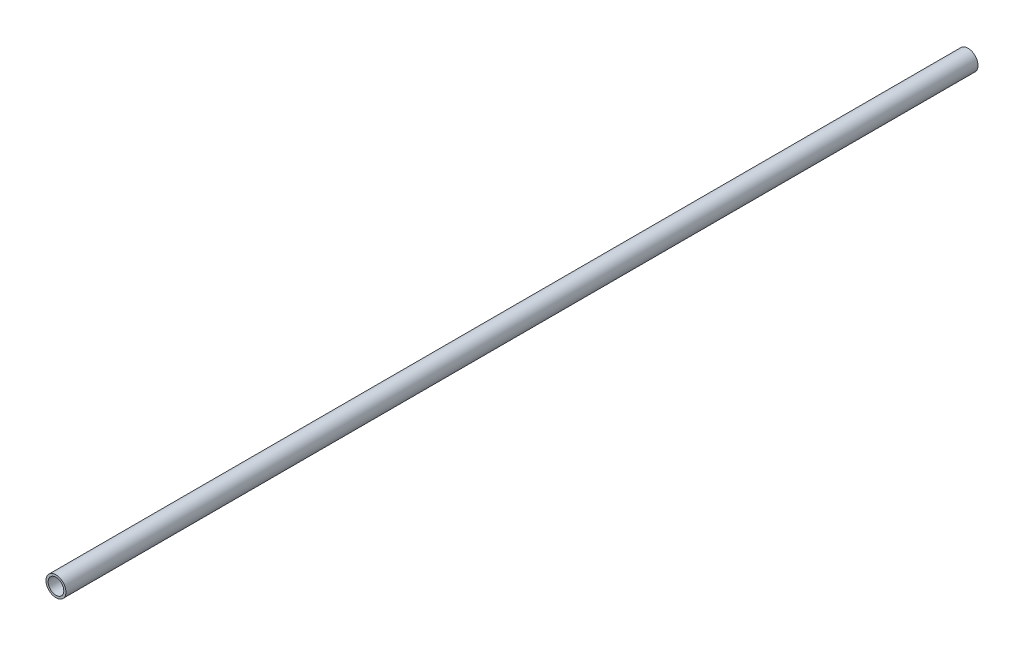
ISO-10303-21;
HEADER;
FILE_DESCRIPTION(('STEP AP214'),'2;1');
FILE_NAME('part.step','',(''),(''),'','','');
FILE_SCHEMA(('AUTOMOTIVE_DESIGN { 1 0 10303 214 1 1 1 1 }'));
ENDSEC;
DATA;
#1=APPLICATION_CONTEXT('core data for automotive mechanical design processes');
#2=APPLICATION_PROTOCOL_DEFINITION('international standard','automotive_design',2000,#1);
#3=PRODUCT_CONTEXT('',#1,'mechanical');
#4=PRODUCT('Part','Part','',(#3));
#5=PRODUCT_RELATED_PRODUCT_CATEGORY('part','',(#4));
#6=PRODUCT_DEFINITION_FORMATION('','',#4);
#7=PRODUCT_DEFINITION_CONTEXT('part definition',#1,'design');
#8=PRODUCT_DEFINITION('design','',#6,#7);
#9=PRODUCT_DEFINITION_SHAPE('','',#8);
#10=(LENGTH_UNIT() NAMED_UNIT(*) SI_UNIT(.MILLI.,.METRE.));
#11=(NAMED_UNIT(*) PLANE_ANGLE_UNIT() SI_UNIT($,.RADIAN.));
#12=(NAMED_UNIT(*) SI_UNIT($,.STERADIAN.) SOLID_ANGLE_UNIT());
#13=UNCERTAINTY_MEASURE_WITH_UNIT(LENGTH_MEASURE(1.E-05),#10,'distance_accuracy_value','');
#14=(GEOMETRIC_REPRESENTATION_CONTEXT(3) GLOBAL_UNCERTAINTY_ASSIGNED_CONTEXT((#13)) GLOBAL_UNIT_ASSIGNED_CONTEXT((#10,
#11,#12)) REPRESENTATION_CONTEXT('',''));
#15=CARTESIAN_POINT('',(0.,0.,0.));
#16=DIRECTION('',(0.,0.,1.));
#17=DIRECTION('',(1.,0.,0.));
#18=AXIS2_PLACEMENT_3D('',#15,#16,#17);
#19=CARTESIAN_POINT('',(0.,0.,762.));
#20=DIRECTION('',(0.,0.,-1.));
#21=DIRECTION('',(-1.,0.,0.));
#22=AXIS2_PLACEMENT_3D('',#19,#20,#21);
#23=CYLINDRICAL_SURFACE('',#22,13.335);
#24=CARTESIAN_POINT('',(0.,0.,-762.));
#25=DIRECTION('',(0.,0.,1.));
#26=DIRECTION('',(1.,0.,0.));
#27=AXIS2_PLACEMENT_3D('',#24,#25,#26);
#28=CIRCLE('',#27,13.335);
#29=CARTESIAN_POINT('',(13.335,0.,-762.));
#30=VERTEX_POINT('',#29);
#31=EDGE_CURVE('E11',#30,#30,#28,.T.);
#32=ORIENTED_EDGE('',*,*,#31,.T.);
#33=EDGE_LOOP('',(#32));
#34=FACE_BOUND('',#33,.T.);
#35=CARTESIAN_POINT('',(0.,0.,457.81833125));
#36=DIRECTION('',(0.,0.,1.));
#37=DIRECTION('',(1.,0.,0.));
#38=AXIS2_PLACEMENT_3D('',#35,#36,#37);
#39=CIRCLE('',#38,13.335);
#40=CARTESIAN_POINT('',(13.335,0.,457.81833125));
#41=VERTEX_POINT('',#40);
#42=EDGE_CURVE('E59',#41,#41,#39,.F.);
#43=ORIENTED_EDGE('',*,*,#42,.T.);
#44=EDGE_LOOP('',(#43));
#45=FACE_BOUND('',#44,.T.);
#46=ADVANCED_FACE('F42',(#34,#45),#23,.T.);
#47=CARTESIAN_POINT('',(0.,0.,762.));
#48=DIRECTION('',(0.,0.,-1.));
#49=DIRECTION('',(-1.,0.,0.));
#50=AXIS2_PLACEMENT_3D('',#47,#48,#49);
#51=CYLINDRICAL_SURFACE('',#50,10.4648);
#52=CARTESIAN_POINT('',(0.,0.,-762.));
#53=DIRECTION('',(0.,0.,1.));
#54=DIRECTION('',(1.,0.,0.));
#55=AXIS2_PLACEMENT_3D('',#52,#53,#54);
#56=CIRCLE('',#55,10.4648);
#57=CARTESIAN_POINT('',(10.4648,0.,-762.));
#58=VERTEX_POINT('',#57);
#59=EDGE_CURVE('E49',#58,#58,#56,.T.);
#60=ORIENTED_EDGE('',*,*,#59,.F.);
#61=EDGE_LOOP('',(#60));
#62=FACE_BOUND('',#61,.T.);
#63=CARTESIAN_POINT('',(0.,0.,457.81833125));
#64=DIRECTION('',(0.,0.,1.));
#65=DIRECTION('',(1.,0.,0.));
#66=AXIS2_PLACEMENT_3D('',#63,#64,#65);
#67=CIRCLE('',#66,10.4648);
#68=CARTESIAN_POINT('',(10.4648,0.,457.81833125));
#69=VERTEX_POINT('',#68);
#70=EDGE_CURVE('E54',#69,#69,#67,.F.);
#71=ORIENTED_EDGE('',*,*,#70,.F.);
#72=EDGE_LOOP('',(#71));
#73=FACE_BOUND('',#72,.T.);
#74=ADVANCED_FACE('F74',(#62,#73),#51,.F.);
#75=CARTESIAN_POINT('',(0.,0.,-762.));
#76=DIRECTION('',(0.,0.,1.));
#77=DIRECTION('',(1.,0.,0.));
#78=AXIS2_PLACEMENT_3D('',#75,#76,#77);
#79=PLANE('',#78);
#80=ORIENTED_EDGE('',*,*,#59,.T.);
#81=EDGE_LOOP('',(#80));
#82=FACE_BOUND('',#81,.T.);
#83=ORIENTED_EDGE('',*,*,#31,.F.);
#84=EDGE_LOOP('',(#83));
#85=FACE_BOUND('',#84,.T.);
#86=ADVANCED_FACE('F70',(#82,#85),#79,.F.);
#87=CARTESIAN_POINT('',(0.,0.,457.81833125));
#88=DIRECTION('',(0.,0.,1.));
#89=DIRECTION('',(1.,0.,0.));
#90=AXIS2_PLACEMENT_3D('',#87,#88,#89);
#91=PLANE('',#90);
#92=ORIENTED_EDGE('',*,*,#42,.F.);
#93=EDGE_LOOP('',(#92));
#94=FACE_BOUND('',#93,.T.);
#95=ORIENTED_EDGE('',*,*,#70,.T.);
#96=EDGE_LOOP('',(#95));
#97=FACE_BOUND('',#96,.T.);
#98=ADVANCED_FACE('F67',(#94,#97),#91,.T.);
#99=CLOSED_SHELL('',(#46,#74,#86,#98));
#100=MANIFOLD_SOLID_BREP('B2',#99);
#101=ADVANCED_BREP_SHAPE_REPRESENTATION('',(#18,#100),#14);
#102=SHAPE_DEFINITION_REPRESENTATION(#9,#101);
ENDSEC;
END-ISO-10303-21;
